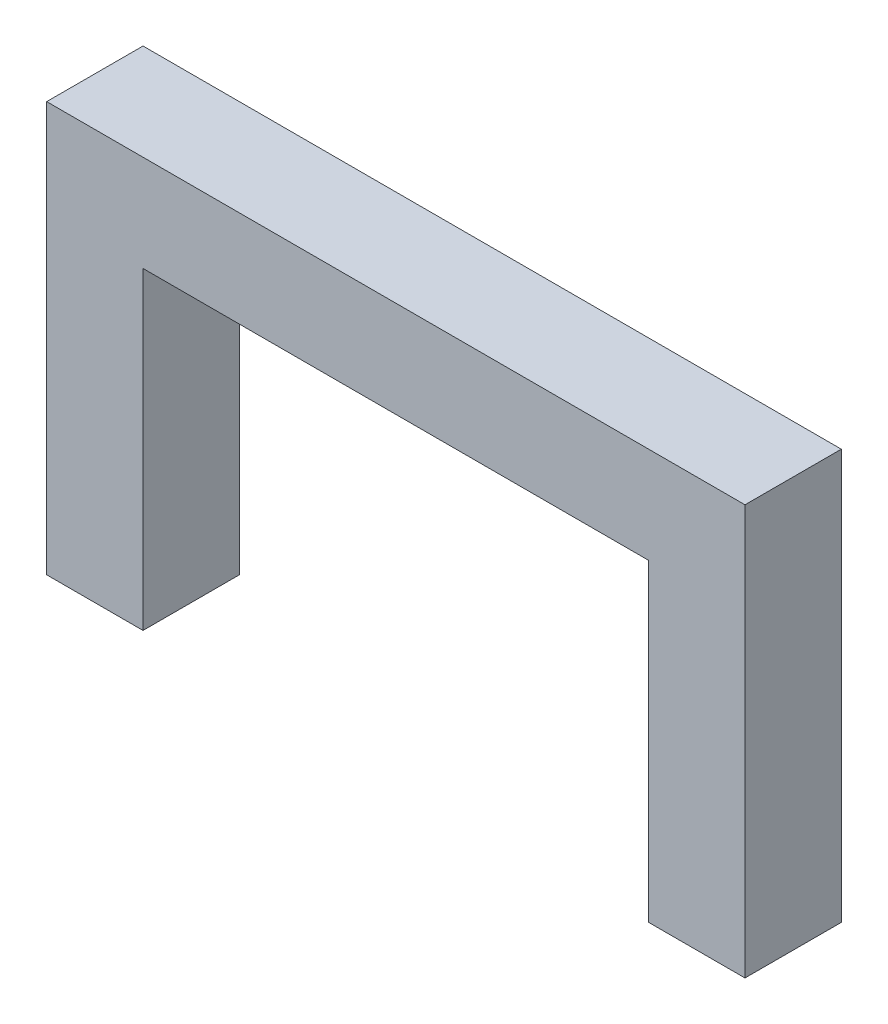
ISO-10303-21;
HEADER;
FILE_DESCRIPTION(('STEP AP214'),'2;1');
FILE_NAME('part.step','',(''),(''),'','','');
FILE_SCHEMA(('AUTOMOTIVE_DESIGN { 1 0 10303 214 1 1 1 1 }'));
ENDSEC;
DATA;
#1=APPLICATION_CONTEXT('core data for automotive mechanical design processes');
#2=APPLICATION_PROTOCOL_DEFINITION('international standard','automotive_design',2000,#1);
#3=PRODUCT_CONTEXT('',#1,'mechanical');
#4=PRODUCT('Part','Part','',(#3));
#5=PRODUCT_RELATED_PRODUCT_CATEGORY('part','',(#4));
#6=PRODUCT_DEFINITION_FORMATION('','',#4);
#7=PRODUCT_DEFINITION_CONTEXT('part definition',#1,'design');
#8=PRODUCT_DEFINITION('design','',#6,#7);
#9=PRODUCT_DEFINITION_SHAPE('','',#8);
#10=(LENGTH_UNIT() NAMED_UNIT(*) SI_UNIT(.MILLI.,.METRE.));
#11=(NAMED_UNIT(*) PLANE_ANGLE_UNIT() SI_UNIT($,.RADIAN.));
#12=(NAMED_UNIT(*) SI_UNIT($,.STERADIAN.) SOLID_ANGLE_UNIT());
#13=UNCERTAINTY_MEASURE_WITH_UNIT(LENGTH_MEASURE(1.E-05),#10,'distance_accuracy_value','');
#14=(GEOMETRIC_REPRESENTATION_CONTEXT(3) GLOBAL_UNCERTAINTY_ASSIGNED_CONTEXT((#13)) GLOBAL_UNIT_ASSIGNED_CONTEXT((#10,
#11,#12)) REPRESENTATION_CONTEXT('',''));
#15=CARTESIAN_POINT('',(0.,0.,0.));
#16=DIRECTION('',(0.,0.,1.));
#17=DIRECTION('',(1.,0.,0.));
#18=AXIS2_PLACEMENT_3D('',#15,#16,#17);
#19=CARTESIAN_POINT('',(0.,62.,0.));
#20=DIRECTION('',(0.,1.,0.));
#21=DIRECTION('',(0.,0.,1.));
#22=AXIS2_PLACEMENT_3D('',#19,#20,#21);
#23=PLANE('',#22);
#24=DIRECTION('',(0.,0.,1.));
#25=VECTOR('',#24,1.);
#26=CARTESIAN_POINT('',(119.05,62.,0.));
#27=LINE('',#26,#25);
#28=CARTESIAN_POINT('',(119.05,62.,0.));
#29=VERTEX_POINT('',#28);
#30=CARTESIAN_POINT('',(119.05,62.,19.05));
#31=VERTEX_POINT('',#30);
#32=EDGE_CURVE('E155',#29,#31,#27,.T.);
#33=ORIENTED_EDGE('',*,*,#32,.T.);
#34=DIRECTION('',(1.,0.,0.));
#35=VECTOR('',#34,1.);
#36=CARTESIAN_POINT('',(0.,62.,19.05));
#37=LINE('',#36,#35);
#38=CARTESIAN_POINT('',(19.05,62.,19.05));
#39=VERTEX_POINT('',#38);
#40=EDGE_CURVE('E120',#39,#31,#37,.T.);
#41=ORIENTED_EDGE('',*,*,#40,.F.);
#42=DIRECTION('',(0.,0.,-1.));
#43=VECTOR('',#42,1.);
#44=CARTESIAN_POINT('',(19.05,62.,0.));
#45=LINE('',#44,#43);
#46=CARTESIAN_POINT('',(19.05,62.,0.));
#47=VERTEX_POINT('',#46);
#48=EDGE_CURVE('E88',#39,#47,#45,.T.);
#49=ORIENTED_EDGE('',*,*,#48,.T.);
#50=DIRECTION('',(-1.,0.,0.));
#51=VECTOR('',#50,1.);
#52=CARTESIAN_POINT('',(0.,62.,0.));
#53=LINE('',#52,#51);
#54=EDGE_CURVE('E81',#29,#47,#53,.T.);
#55=ORIENTED_EDGE('',*,*,#54,.F.);
#56=EDGE_LOOP('',(#33,#41,#49,#55));
#57=FACE_BOUND('',#56,.T.);
#58=ADVANCED_FACE('F33',(#57),#23,.F.);
#59=CARTESIAN_POINT('',(0.,62.,0.));
#60=DIRECTION('',(1.,0.,0.));
#61=DIRECTION('',(0.,0.,-1.));
#62=AXIS2_PLACEMENT_3D('',#59,#60,#61);
#63=PLANE('',#62);
#64=DIRECTION('',(0.,0.,1.));
#65=VECTOR('',#64,1.);
#66=CARTESIAN_POINT('',(0.,0.,0.));
#67=LINE('',#66,#65);
#68=CARTESIAN_POINT('',(0.,0.,0.));
#69=VERTEX_POINT('',#68);
#70=CARTESIAN_POINT('',(0.,0.,19.05));
#71=VERTEX_POINT('',#70);
#72=EDGE_CURVE('E87',#69,#71,#67,.T.);
#73=ORIENTED_EDGE('',*,*,#72,.T.);
#74=DIRECTION('',(0.,-1.,0.));
#75=VECTOR('',#74,1.);
#76=CARTESIAN_POINT('',(0.,62.,19.05));
#77=LINE('',#76,#75);
#78=CARTESIAN_POINT('',(0.,81.05,19.05));
#79=VERTEX_POINT('',#78);
#80=EDGE_CURVE('E11',#79,#71,#77,.T.);
#81=ORIENTED_EDGE('',*,*,#80,.F.);
#82=DIRECTION('',(0.,0.,1.));
#83=VECTOR('',#82,1.);
#84=CARTESIAN_POINT('',(0.,81.05,0.));
#85=LINE('',#84,#83);
#86=CARTESIAN_POINT('',(0.,81.05,0.));
#87=VERTEX_POINT('',#86);
#88=EDGE_CURVE('E98',#87,#79,#85,.T.);
#89=ORIENTED_EDGE('',*,*,#88,.F.);
#90=DIRECTION('',(0.,-1.,0.));
#91=VECTOR('',#90,1.);
#92=CARTESIAN_POINT('',(0.,62.,0.));
#93=LINE('',#92,#91);
#94=EDGE_CURVE('E82',#87,#69,#93,.T.);
#95=ORIENTED_EDGE('',*,*,#94,.T.);
#96=EDGE_LOOP('',(#73,#81,#89,#95));
#97=FACE_BOUND('',#96,.T.);
#98=ADVANCED_FACE('F35',(#97),#63,.F.);
#99=CARTESIAN_POINT('',(0.,62.,19.05));
#100=DIRECTION('',(0.,0.,-1.));
#101=DIRECTION('',(-1.,0.,0.));
#102=AXIS2_PLACEMENT_3D('',#99,#100,#101);
#103=PLANE('',#102);
#104=DIRECTION('',(1.,0.,0.));
#105=VECTOR('',#104,1.);
#106=CARTESIAN_POINT('',(0.,0.,19.05));
#107=LINE('',#106,#105);
#108=CARTESIAN_POINT('',(19.05,0.,19.05));
#109=VERTEX_POINT('',#108);
#110=EDGE_CURVE('E72',#71,#109,#107,.T.);
#111=ORIENTED_EDGE('',*,*,#110,.T.);
#112=DIRECTION('',(0.,-1.,0.));
#113=VECTOR('',#112,1.);
#114=CARTESIAN_POINT('',(19.05,62.,19.05));
#115=LINE('',#114,#113);
#116=EDGE_CURVE('E42',#39,#109,#115,.T.);
#117=ORIENTED_EDGE('',*,*,#116,.F.);
#118=ORIENTED_EDGE('',*,*,#40,.T.);
#119=DIRECTION('',(0.,-1.,0.));
#120=VECTOR('',#119,1.);
#121=CARTESIAN_POINT('',(119.05,62.,19.05));
#122=LINE('',#121,#120);
#123=CARTESIAN_POINT('',(119.05,0.,19.05));
#124=VERTEX_POINT('',#123);
#125=EDGE_CURVE('E122',#31,#124,#122,.T.);
#126=ORIENTED_EDGE('',*,*,#125,.T.);
#127=DIRECTION('',(1.,0.,0.));
#128=VECTOR('',#127,1.);
#129=CARTESIAN_POINT('',(119.05,0.,19.05));
#130=LINE('',#129,#128);
#131=CARTESIAN_POINT('',(138.1,0.,19.05));
#132=VERTEX_POINT('',#131);
#133=EDGE_CURVE('E170',#124,#132,#130,.T.);
#134=ORIENTED_EDGE('',*,*,#133,.T.);
#135=DIRECTION('',(0.,-1.,0.));
#136=VECTOR('',#135,1.);
#137=CARTESIAN_POINT('',(138.1,81.05,19.05));
#138=LINE('',#137,#136);
#139=CARTESIAN_POINT('',(138.1,81.05,19.05));
#140=VERTEX_POINT('',#139);
#141=EDGE_CURVE('E114',#140,#132,#138,.T.);
#142=ORIENTED_EDGE('',*,*,#141,.F.);
#143=DIRECTION('',(1.,0.,0.));
#144=VECTOR('',#143,1.);
#145=CARTESIAN_POINT('',(0.,81.05,19.05));
#146=LINE('',#145,#144);
#147=EDGE_CURVE('E116',#79,#140,#146,.T.);
#148=ORIENTED_EDGE('',*,*,#147,.F.);
#149=ORIENTED_EDGE('',*,*,#80,.T.);
#150=EDGE_LOOP('',(#111,#117,#118,#126,#134,#142,#148,#149));
#151=FACE_BOUND('',#150,.T.);
#152=ADVANCED_FACE('F126',(#151),#103,.F.);
#153=CARTESIAN_POINT('',(19.05,62.,0.));
#154=DIRECTION('',(-1.,0.,0.));
#155=DIRECTION('',(0.,0.,1.));
#156=AXIS2_PLACEMENT_3D('',#153,#154,#155);
#157=PLANE('',#156);
#158=DIRECTION('',(0.,0.,-1.));
#159=VECTOR('',#158,1.);
#160=CARTESIAN_POINT('',(19.05,0.,0.));
#161=LINE('',#160,#159);
#162=CARTESIAN_POINT('',(19.05,0.,0.));
#163=VERTEX_POINT('',#162);
#164=EDGE_CURVE('E64',#109,#163,#161,.T.);
#165=ORIENTED_EDGE('',*,*,#164,.T.);
#166=DIRECTION('',(0.,-1.,0.));
#167=VECTOR('',#166,1.);
#168=CARTESIAN_POINT('',(19.05,62.,0.));
#169=LINE('',#168,#167);
#170=EDGE_CURVE('E67',#47,#163,#169,.T.);
#171=ORIENTED_EDGE('',*,*,#170,.F.);
#172=ORIENTED_EDGE('',*,*,#48,.F.);
#173=ORIENTED_EDGE('',*,*,#116,.T.);
#174=EDGE_LOOP('',(#165,#171,#172,#173));
#175=FACE_BOUND('',#174,.T.);
#176=ADVANCED_FACE('F66',(#175),#157,.F.);
#177=CARTESIAN_POINT('',(0.,62.,0.));
#178=DIRECTION('',(0.,0.,1.));
#179=DIRECTION('',(1.,0.,0.));
#180=AXIS2_PLACEMENT_3D('',#177,#178,#179);
#181=PLANE('',#180);
#182=DIRECTION('',(-1.,0.,0.));
#183=VECTOR('',#182,1.);
#184=CARTESIAN_POINT('',(0.,0.,0.));
#185=LINE('',#184,#183);
#186=EDGE_CURVE('E71',#163,#69,#185,.T.);
#187=ORIENTED_EDGE('',*,*,#186,.T.);
#188=ORIENTED_EDGE('',*,*,#94,.F.);
#189=DIRECTION('',(-1.,0.,0.));
#190=VECTOR('',#189,1.);
#191=CARTESIAN_POINT('',(0.,81.05,0.));
#192=LINE('',#191,#190);
#193=CARTESIAN_POINT('',(138.1,81.05,0.));
#194=VERTEX_POINT('',#193);
#195=EDGE_CURVE('E103',#194,#87,#192,.T.);
#196=ORIENTED_EDGE('',*,*,#195,.F.);
#197=DIRECTION('',(0.,-1.,0.));
#198=VECTOR('',#197,1.);
#199=CARTESIAN_POINT('',(138.1,81.05,0.));
#200=LINE('',#199,#198);
#201=CARTESIAN_POINT('',(138.1,0.,0.));
#202=VERTEX_POINT('',#201);
#203=EDGE_CURVE('E112',#194,#202,#200,.T.);
#204=ORIENTED_EDGE('',*,*,#203,.T.);
#205=DIRECTION('',(-1.,0.,0.));
#206=VECTOR('',#205,1.);
#207=CARTESIAN_POINT('',(119.05,0.,0.));
#208=LINE('',#207,#206);
#209=CARTESIAN_POINT('',(119.05,0.,0.));
#210=VERTEX_POINT('',#209);
#211=EDGE_CURVE('E163',#202,#210,#208,.T.);
#212=ORIENTED_EDGE('',*,*,#211,.T.);
#213=DIRECTION('',(0.,-1.,0.));
#214=VECTOR('',#213,1.);
#215=CARTESIAN_POINT('',(119.05,62.,0.));
#216=LINE('',#215,#214);
#217=EDGE_CURVE('E159',#29,#210,#216,.T.);
#218=ORIENTED_EDGE('',*,*,#217,.F.);
#219=ORIENTED_EDGE('',*,*,#54,.T.);
#220=ORIENTED_EDGE('',*,*,#170,.T.);
#221=EDGE_LOOP('',(#187,#188,#196,#204,#212,#218,#219,#220));
#222=FACE_BOUND('',#221,.T.);
#223=ADVANCED_FACE('F76',(#222),#181,.F.);
#224=CARTESIAN_POINT('',(0.,0.,0.));
#225=DIRECTION('',(0.,1.,0.));
#226=DIRECTION('',(0.,0.,1.));
#227=AXIS2_PLACEMENT_3D('',#224,#225,#226);
#228=PLANE('',#227);
#229=ORIENTED_EDGE('',*,*,#72,.F.);
#230=ORIENTED_EDGE('',*,*,#186,.F.);
#231=ORIENTED_EDGE('',*,*,#164,.F.);
#232=ORIENTED_EDGE('',*,*,#110,.F.);
#233=EDGE_LOOP('',(#229,#230,#231,#232));
#234=FACE_BOUND('',#233,.T.);
#235=ADVANCED_FACE('F85',(#234),#228,.F.);
#236=CARTESIAN_POINT('',(138.1,81.05,0.));
#237=DIRECTION('',(-1.,0.,0.));
#238=DIRECTION('',(0.,0.,1.));
#239=AXIS2_PLACEMENT_3D('',#236,#237,#238);
#240=PLANE('',#239);
#241=ORIENTED_EDGE('',*,*,#141,.T.);
#242=DIRECTION('',(0.,0.,-1.));
#243=VECTOR('',#242,1.);
#244=CARTESIAN_POINT('',(138.1,0.,0.));
#245=LINE('',#244,#243);
#246=EDGE_CURVE('E166',#132,#202,#245,.T.);
#247=ORIENTED_EDGE('',*,*,#246,.T.);
#248=ORIENTED_EDGE('',*,*,#203,.F.);
#249=DIRECTION('',(0.,0.,-1.));
#250=VECTOR('',#249,1.);
#251=CARTESIAN_POINT('',(138.1,81.05,0.));
#252=LINE('',#251,#250);
#253=EDGE_CURVE('E110',#140,#194,#252,.T.);
#254=ORIENTED_EDGE('',*,*,#253,.F.);
#255=EDGE_LOOP('',(#241,#247,#248,#254));
#256=FACE_BOUND('',#255,.T.);
#257=ADVANCED_FACE('F176',(#256),#240,.F.);
#258=CARTESIAN_POINT('',(0.,81.05,0.));
#259=DIRECTION('',(0.,1.,0.));
#260=DIRECTION('',(0.,0.,1.));
#261=AXIS2_PLACEMENT_3D('',#258,#259,#260);
#262=PLANE('',#261);
#263=ORIENTED_EDGE('',*,*,#88,.T.);
#264=ORIENTED_EDGE('',*,*,#147,.T.);
#265=ORIENTED_EDGE('',*,*,#253,.T.);
#266=ORIENTED_EDGE('',*,*,#195,.T.);
#267=EDGE_LOOP('',(#263,#264,#265,#266));
#268=FACE_BOUND('',#267,.T.);
#269=ADVANCED_FACE('F106',(#268),#262,.T.);
#270=CARTESIAN_POINT('',(119.05,62.,0.));
#271=DIRECTION('',(1.,0.,0.));
#272=DIRECTION('',(0.,0.,-1.));
#273=AXIS2_PLACEMENT_3D('',#270,#271,#272);
#274=PLANE('',#273);
#275=DIRECTION('',(0.,0.,1.));
#276=VECTOR('',#275,1.);
#277=CARTESIAN_POINT('',(119.05,0.,0.));
#278=LINE('',#277,#276);
#279=EDGE_CURVE('E157',#210,#124,#278,.T.);
#280=ORIENTED_EDGE('',*,*,#279,.T.);
#281=ORIENTED_EDGE('',*,*,#125,.F.);
#282=ORIENTED_EDGE('',*,*,#32,.F.);
#283=ORIENTED_EDGE('',*,*,#217,.T.);
#284=EDGE_LOOP('',(#280,#281,#282,#283));
#285=FACE_BOUND('',#284,.T.);
#286=ADVANCED_FACE('F153',(#285),#274,.F.);
#287=CARTESIAN_POINT('',(0.,0.,0.));
#288=DIRECTION('',(0.,1.,0.));
#289=DIRECTION('',(0.,0.,1.));
#290=AXIS2_PLACEMENT_3D('',#287,#288,#289);
#291=PLANE('',#290);
#292=ORIENTED_EDGE('',*,*,#279,.F.);
#293=ORIENTED_EDGE('',*,*,#211,.F.);
#294=ORIENTED_EDGE('',*,*,#246,.F.);
#295=ORIENTED_EDGE('',*,*,#133,.F.);
#296=EDGE_LOOP('',(#292,#293,#294,#295));
#297=FACE_BOUND('',#296,.T.);
#298=ADVANCED_FACE('F179',(#297),#291,.F.);
#299=CLOSED_SHELL('',(#58,#98,#152,#176,#223,#235,#257,#269,#286,#298));
#300=MANIFOLD_SOLID_BREP('B2',#299);
#301=ADVANCED_BREP_SHAPE_REPRESENTATION('',(#18,#300),#14);
#302=SHAPE_DEFINITION_REPRESENTATION(#9,#301);
ENDSEC;
END-ISO-10303-21;
